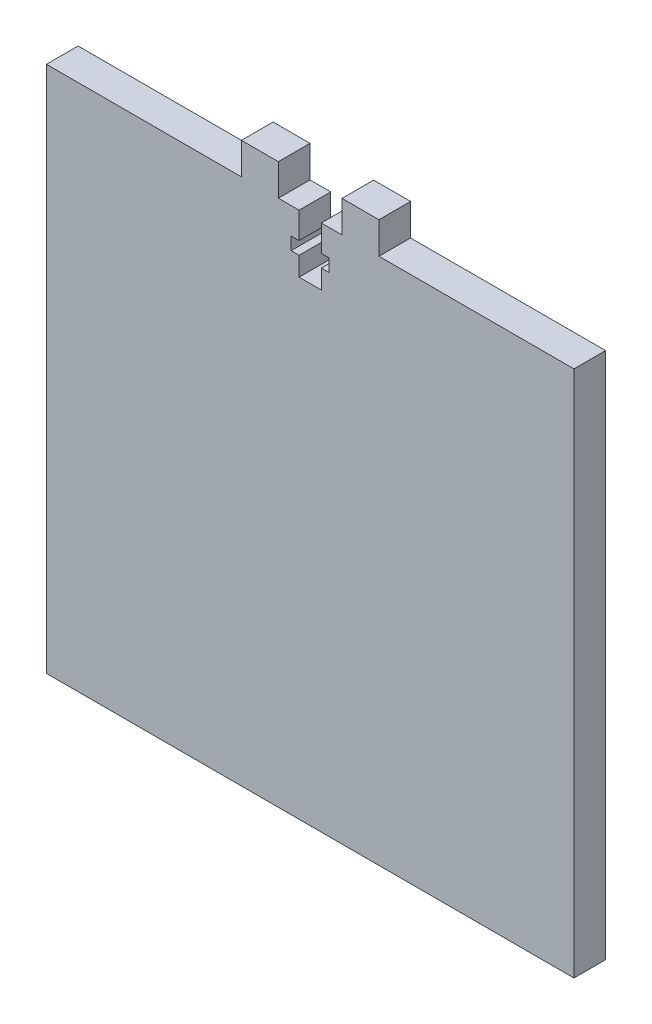
ISO-10303-21;
HEADER;
FILE_DESCRIPTION(('STEP AP214'),'2;1');
FILE_NAME('part.step','',(''),(''),'','','');
FILE_SCHEMA(('AUTOMOTIVE_DESIGN { 1 0 10303 214 1 1 1 1 }'));
ENDSEC;
DATA;
#1=APPLICATION_CONTEXT('core data for automotive mechanical design processes');
#2=APPLICATION_PROTOCOL_DEFINITION('international standard','automotive_design',2000,#1);
#3=PRODUCT_CONTEXT('',#1,'mechanical');
#4=PRODUCT('Part','Part','',(#3));
#5=PRODUCT_RELATED_PRODUCT_CATEGORY('part','',(#4));
#6=PRODUCT_DEFINITION_FORMATION('','',#4);
#7=PRODUCT_DEFINITION_CONTEXT('part definition',#1,'design');
#8=PRODUCT_DEFINITION('design','',#6,#7);
#9=PRODUCT_DEFINITION_SHAPE('','',#8);
#10=(LENGTH_UNIT() NAMED_UNIT(*) SI_UNIT(.MILLI.,.METRE.));
#11=(NAMED_UNIT(*) PLANE_ANGLE_UNIT() SI_UNIT($,.RADIAN.));
#12=(NAMED_UNIT(*) SI_UNIT($,.STERADIAN.) SOLID_ANGLE_UNIT());
#13=UNCERTAINTY_MEASURE_WITH_UNIT(LENGTH_MEASURE(1.E-05),#10,'distance_accuracy_value','');
#14=(GEOMETRIC_REPRESENTATION_CONTEXT(3) GLOBAL_UNCERTAINTY_ASSIGNED_CONTEXT((#13)) GLOBAL_UNIT_ASSIGNED_CONTEXT((#10,
#11,#12)) REPRESENTATION_CONTEXT('',''));
#15=CARTESIAN_POINT('',(0.,0.,0.));
#16=DIRECTION('',(0.,0.,1.));
#17=DIRECTION('',(1.,0.,0.));
#18=AXIS2_PLACEMENT_3D('',#15,#16,#17);
#19=CARTESIAN_POINT('',(-50.,50.,6.));
#20=DIRECTION('',(0.,-1.,0.));
#21=DIRECTION('',(0.,0.,-1.));
#22=AXIS2_PLACEMENT_3D('',#19,#20,#21);
#23=PLANE('',#22);
#24=DIRECTION('',(-1.,0.,0.));
#25=VECTOR('',#24,1.);
#26=CARTESIAN_POINT('',(-50.,50.,6.));
#27=LINE('',#26,#25);
#28=CARTESIAN_POINT('',(-2.10000000000001,50.,6.));
#29=VERTEX_POINT('',#28);
#30=CARTESIAN_POINT('',(-6.03184990821574,50.,6.));
#31=VERTEX_POINT('',#30);
#32=EDGE_CURVE('E358',#29,#31,#27,.T.);
#33=ORIENTED_EDGE('',*,*,#32,.F.);
#34=DIRECTION('',(0.,0.,1.));
#35=VECTOR('',#34,1.);
#36=CARTESIAN_POINT('',(-2.10000000000001,50.,0.));
#37=LINE('',#36,#35);
#38=CARTESIAN_POINT('',(-2.10000000000001,50.,0.));
#39=VERTEX_POINT('',#38);
#40=EDGE_CURVE('E275',#39,#29,#37,.T.);
#41=ORIENTED_EDGE('',*,*,#40,.F.);
#42=DIRECTION('',(-1.,0.,0.));
#43=VECTOR('',#42,1.);
#44=CARTESIAN_POINT('',(-50.,50.,0.));
#45=LINE('',#44,#43);
#46=CARTESIAN_POINT('',(-6.03184990821574,50.,0.));
#47=VERTEX_POINT('',#46);
#48=EDGE_CURVE('E219',#39,#47,#45,.T.);
#49=ORIENTED_EDGE('',*,*,#48,.T.);
#50=DIRECTION('',(0.,0.,1.));
#51=VECTOR('',#50,1.);
#52=CARTESIAN_POINT('',(-6.03184990821574,50.,0.));
#53=LINE('',#52,#51);
#54=EDGE_CURVE('E345',#47,#31,#53,.T.);
#55=ORIENTED_EDGE('',*,*,#54,.T.);
#56=EDGE_LOOP('',(#33,#41,#49,#55));
#57=FACE_BOUND('',#56,.T.);
#58=ADVANCED_FACE('F35',(#57),#23,.F.);
#59=CARTESIAN_POINT('',(50.,50.,0.));
#60=VERTEX_POINT('',#59);
#61=CARTESIAN_POINT('',(13.0318499082157,50.,0.));
#62=VERTEX_POINT('',#61);
#63=EDGE_CURVE('E366',#60,#62,#45,.T.);
#64=ORIENTED_EDGE('',*,*,#63,.T.);
#65=DIRECTION('',(0.,0.,1.));
#66=VECTOR('',#65,1.);
#67=CARTESIAN_POINT('',(13.0318499082157,50.,0.));
#68=LINE('',#67,#66);
#69=CARTESIAN_POINT('',(13.0318499082157,50.,6.));
#70=VERTEX_POINT('',#69);
#71=EDGE_CURVE('E315',#62,#70,#68,.T.);
#72=ORIENTED_EDGE('',*,*,#71,.T.);
#73=CARTESIAN_POINT('',(50.,50.,6.));
#74=VERTEX_POINT('',#73);
#75=EDGE_CURVE('E354',#74,#70,#27,.T.);
#76=ORIENTED_EDGE('',*,*,#75,.F.);
#77=DIRECTION('',(0.,0.,-1.));
#78=VECTOR('',#77,1.);
#79=CARTESIAN_POINT('',(50.,50.,6.));
#80=LINE('',#79,#78);
#81=EDGE_CURVE('E11',#74,#60,#80,.T.);
#82=ORIENTED_EDGE('',*,*,#81,.T.);
#83=EDGE_LOOP('',(#64,#72,#76,#82));
#84=FACE_BOUND('',#83,.T.);
#85=ADVANCED_FACE('F465',(#84),#23,.F.);
#86=DIRECTION('',(0.,0.,1.));
#87=VECTOR('',#86,1.);
#88=CARTESIAN_POINT('',(-13.0318499082157,50.,0.));
#89=LINE('',#88,#87);
#90=CARTESIAN_POINT('',(-13.0318499082157,50.,0.));
#91=VERTEX_POINT('',#90);
#92=CARTESIAN_POINT('',(-13.0318499082157,50.,6.));
#93=VERTEX_POINT('',#92);
#94=EDGE_CURVE('E332',#91,#93,#89,.T.);
#95=ORIENTED_EDGE('',*,*,#94,.F.);
#96=CARTESIAN_POINT('',(-50.,50.,0.));
#97=VERTEX_POINT('',#96);
#98=EDGE_CURVE('E365',#91,#97,#45,.T.);
#99=ORIENTED_EDGE('',*,*,#98,.T.);
#100=DIRECTION('',(0.,0.,-1.));
#101=VECTOR('',#100,1.);
#102=CARTESIAN_POINT('',(-50.,50.,6.));
#103=LINE('',#102,#101);
#104=CARTESIAN_POINT('',(-50.,50.,6.));
#105=VERTEX_POINT('',#104);
#106=EDGE_CURVE('E43',#105,#97,#103,.T.);
#107=ORIENTED_EDGE('',*,*,#106,.F.);
#108=EDGE_CURVE('E352',#93,#105,#27,.T.);
#109=ORIENTED_EDGE('',*,*,#108,.F.);
#110=EDGE_LOOP('',(#95,#99,#107,#109));
#111=FACE_BOUND('',#110,.T.);
#112=ADVANCED_FACE('F410',(#111),#23,.F.);
#113=CARTESIAN_POINT('',(50.,-50.,6.));
#114=DIRECTION('',(-1.,0.,0.));
#115=DIRECTION('',(0.,0.,1.));
#116=AXIS2_PLACEMENT_3D('',#113,#114,#115);
#117=PLANE('',#116);
#118=DIRECTION('',(0.,1.,0.));
#119=VECTOR('',#118,1.);
#120=CARTESIAN_POINT('',(50.,-50.,0.));
#121=LINE('',#120,#119);
#122=CARTESIAN_POINT('',(50.,-50.,0.));
#123=VERTEX_POINT('',#122);
#124=EDGE_CURVE('E342',#123,#60,#121,.T.);
#125=ORIENTED_EDGE('',*,*,#124,.T.);
#126=ORIENTED_EDGE('',*,*,#81,.F.);
#127=DIRECTION('',(0.,1.,0.));
#128=VECTOR('',#127,1.);
#129=CARTESIAN_POINT('',(50.,-50.,6.));
#130=LINE('',#129,#128);
#131=CARTESIAN_POINT('',(50.,-50.,6.));
#132=VERTEX_POINT('',#131);
#133=EDGE_CURVE('E349',#132,#74,#130,.T.);
#134=ORIENTED_EDGE('',*,*,#133,.F.);
#135=DIRECTION('',(0.,0.,-1.));
#136=VECTOR('',#135,1.);
#137=CARTESIAN_POINT('',(50.,-50.,6.));
#138=LINE('',#137,#136);
#139=EDGE_CURVE('E362',#132,#123,#138,.T.);
#140=ORIENTED_EDGE('',*,*,#139,.T.);
#141=EDGE_LOOP('',(#125,#126,#134,#140));
#142=FACE_BOUND('',#141,.T.);
#143=ADVANCED_FACE('F37',(#142),#117,.F.);
#144=CARTESIAN_POINT('',(6.03184990821572,50.,0.));
#145=VERTEX_POINT('',#144);
#146=CARTESIAN_POINT('',(2.09999999999999,50.,0.));
#147=VERTEX_POINT('',#146);
#148=EDGE_CURVE('E369',#145,#147,#45,.T.);
#149=ORIENTED_EDGE('',*,*,#148,.T.);
#150=DIRECTION('',(0.,0.,1.));
#151=VECTOR('',#150,1.);
#152=CARTESIAN_POINT('',(2.09999999999999,50.,0.));
#153=LINE('',#152,#151);
#154=CARTESIAN_POINT('',(2.09999999999999,50.,6.));
#155=VERTEX_POINT('',#154);
#156=EDGE_CURVE('E278',#147,#155,#153,.T.);
#157=ORIENTED_EDGE('',*,*,#156,.T.);
#158=CARTESIAN_POINT('',(6.03184990821572,50.,6.));
#159=VERTEX_POINT('',#158);
#160=EDGE_CURVE('E58',#159,#155,#27,.T.);
#161=ORIENTED_EDGE('',*,*,#160,.F.);
#162=DIRECTION('',(0.,0.,1.));
#163=VECTOR('',#162,1.);
#164=CARTESIAN_POINT('',(6.03184990821572,50.,0.));
#165=LINE('',#164,#163);
#166=EDGE_CURVE('E318',#145,#159,#165,.T.);
#167=ORIENTED_EDGE('',*,*,#166,.F.);
#168=EDGE_LOOP('',(#149,#157,#161,#167));
#169=FACE_BOUND('',#168,.T.);
#170=ADVANCED_FACE('F409',(#169),#23,.F.);
#171=CARTESIAN_POINT('',(-50.,-50.,6.));
#172=DIRECTION('',(1.,0.,0.));
#173=DIRECTION('',(0.,0.,-1.));
#174=AXIS2_PLACEMENT_3D('',#171,#172,#173);
#175=PLANE('',#174);
#176=DIRECTION('',(0.,-1.,0.));
#177=VECTOR('',#176,1.);
#178=CARTESIAN_POINT('',(-50.,-50.,0.));
#179=LINE('',#178,#177);
#180=CARTESIAN_POINT('',(-50.,-50.,0.));
#181=VERTEX_POINT('',#180);
#182=EDGE_CURVE('E368',#97,#181,#179,.T.);
#183=ORIENTED_EDGE('',*,*,#182,.T.);
#184=DIRECTION('',(0.,0.,-1.));
#185=VECTOR('',#184,1.);
#186=CARTESIAN_POINT('',(-50.,-50.,6.));
#187=LINE('',#186,#185);
#188=CARTESIAN_POINT('',(-50.,-50.,6.));
#189=VERTEX_POINT('',#188);
#190=EDGE_CURVE('E374',#189,#181,#187,.T.);
#191=ORIENTED_EDGE('',*,*,#190,.F.);
#192=DIRECTION('',(0.,-1.,0.));
#193=VECTOR('',#192,1.);
#194=CARTESIAN_POINT('',(-50.,-50.,6.));
#195=LINE('',#194,#193);
#196=EDGE_CURVE('E357',#105,#189,#195,.T.);
#197=ORIENTED_EDGE('',*,*,#196,.F.);
#198=ORIENTED_EDGE('',*,*,#106,.T.);
#199=EDGE_LOOP('',(#183,#191,#197,#198));
#200=FACE_BOUND('',#199,.T.);
#201=ADVANCED_FACE('F381',(#200),#175,.F.);
#202=CARTESIAN_POINT('',(-50.,-50.,6.));
#203=DIRECTION('',(0.,1.,0.));
#204=DIRECTION('',(0.,0.,1.));
#205=AXIS2_PLACEMENT_3D('',#202,#203,#204);
#206=PLANE('',#205);
#207=DIRECTION('',(1.,0.,0.));
#208=VECTOR('',#207,1.);
#209=CARTESIAN_POINT('',(-50.,-50.,0.));
#210=LINE('',#209,#208);
#211=EDGE_CURVE('E353',#181,#123,#210,.T.);
#212=ORIENTED_EDGE('',*,*,#211,.T.);
#213=ORIENTED_EDGE('',*,*,#139,.F.);
#214=DIRECTION('',(1.,0.,0.));
#215=VECTOR('',#214,1.);
#216=CARTESIAN_POINT('',(-50.,-50.,6.));
#217=LINE('',#216,#215);
#218=EDGE_CURVE('E360',#189,#132,#217,.T.);
#219=ORIENTED_EDGE('',*,*,#218,.F.);
#220=ORIENTED_EDGE('',*,*,#190,.T.);
#221=EDGE_LOOP('',(#212,#213,#219,#220));
#222=FACE_BOUND('',#221,.T.);
#223=ADVANCED_FACE('F391',(#222),#206,.F.);
#224=CARTESIAN_POINT('',(0.,0.,6.));
#225=DIRECTION('',(0.,0.,-1.));
#226=DIRECTION('',(-1.,0.,0.));
#227=AXIS2_PLACEMENT_3D('',#224,#225,#226);
#228=PLANE('',#227);
#229=DIRECTION('',(-1.,0.,0.));
#230=VECTOR('',#229,1.);
#231=CARTESIAN_POINT('',(-2.10000000000001,45.,6.));
#232=LINE('',#231,#230);
#233=CARTESIAN_POINT('',(-2.10000000000001,45.,6.));
#234=VERTEX_POINT('',#233);
#235=CARTESIAN_POINT('',(-3.60000000000001,45.,6.));
#236=VERTEX_POINT('',#235);
#237=EDGE_CURVE('E250',#234,#236,#232,.T.);
#238=ORIENTED_EDGE('',*,*,#237,.F.);
#239=DIRECTION('',(0.,-1.,0.));
#240=VECTOR('',#239,1.);
#241=CARTESIAN_POINT('',(-2.10000000000001,45.,6.));
#242=LINE('',#241,#240);
#243=EDGE_CURVE('E204',#29,#234,#242,.T.);
#244=ORIENTED_EDGE('',*,*,#243,.F.);
#245=ORIENTED_EDGE('',*,*,#32,.T.);
#246=DIRECTION('',(0.,1.,0.));
#247=VECTOR('',#246,1.);
#248=CARTESIAN_POINT('',(-6.03184990821574,50.,6.));
#249=LINE('',#248,#247);
#250=CARTESIAN_POINT('',(-6.03184990821574,56.,6.));
#251=VERTEX_POINT('',#250);
#252=EDGE_CURVE('E335',#31,#251,#249,.T.);
#253=ORIENTED_EDGE('',*,*,#252,.T.);
#254=DIRECTION('',(-1.,0.,0.));
#255=VECTOR('',#254,1.);
#256=CARTESIAN_POINT('',(-13.0318499082157,56.,6.));
#257=LINE('',#256,#255);
#258=CARTESIAN_POINT('',(-13.0318499082157,56.,6.));
#259=VERTEX_POINT('',#258);
#260=EDGE_CURVE('E326',#251,#259,#257,.T.);
#261=ORIENTED_EDGE('',*,*,#260,.T.);
#262=DIRECTION('',(0.,-1.,0.));
#263=VECTOR('',#262,1.);
#264=CARTESIAN_POINT('',(-13.0318499082157,50.,6.));
#265=LINE('',#264,#263);
#266=EDGE_CURVE('E317',#259,#93,#265,.T.);
#267=ORIENTED_EDGE('',*,*,#266,.T.);
#268=ORIENTED_EDGE('',*,*,#108,.T.);
#269=ORIENTED_EDGE('',*,*,#196,.T.);
#270=ORIENTED_EDGE('',*,*,#218,.T.);
#271=ORIENTED_EDGE('',*,*,#133,.T.);
#272=ORIENTED_EDGE('',*,*,#75,.T.);
#273=DIRECTION('',(0.,1.,0.));
#274=VECTOR('',#273,1.);
#275=CARTESIAN_POINT('',(13.0318499082157,50.,6.));
#276=LINE('',#275,#274);
#277=CARTESIAN_POINT('',(13.0318499082157,56.,6.));
#278=VERTEX_POINT('',#277);
#279=EDGE_CURVE('E277',#70,#278,#276,.T.);
#280=ORIENTED_EDGE('',*,*,#279,.T.);
#281=DIRECTION('',(-1.,0.,0.));
#282=VECTOR('',#281,1.);
#283=CARTESIAN_POINT('',(13.0318499082157,56.,6.));
#284=LINE('',#283,#282);
#285=CARTESIAN_POINT('',(6.03184990821572,56.,6.));
#286=VERTEX_POINT('',#285);
#287=EDGE_CURVE('E310',#278,#286,#284,.T.);
#288=ORIENTED_EDGE('',*,*,#287,.T.);
#289=DIRECTION('',(0.,-1.,0.));
#290=VECTOR('',#289,1.);
#291=CARTESIAN_POINT('',(6.03184990821572,50.,6.));
#292=LINE('',#291,#290);
#293=EDGE_CURVE('E301',#286,#159,#292,.T.);
#294=ORIENTED_EDGE('',*,*,#293,.T.);
#295=ORIENTED_EDGE('',*,*,#160,.T.);
#296=DIRECTION('',(0.,1.,0.));
#297=VECTOR('',#296,1.);
#298=CARTESIAN_POINT('',(2.09999999999999,50.,6.));
#299=LINE('',#298,#297);
#300=CARTESIAN_POINT('',(2.09999999999999,45.,6.));
#301=VERTEX_POINT('',#300);
#302=EDGE_CURVE('E220',#301,#155,#299,.T.);
#303=ORIENTED_EDGE('',*,*,#302,.F.);
#304=DIRECTION('',(-1.,0.,0.));
#305=VECTOR('',#304,1.);
#306=CARTESIAN_POINT('',(2.09999999999999,45.,6.));
#307=LINE('',#306,#305);
#308=CARTESIAN_POINT('',(3.59999999999999,45.,6.));
#309=VERTEX_POINT('',#308);
#310=EDGE_CURVE('E222',#309,#301,#307,.T.);
#311=ORIENTED_EDGE('',*,*,#310,.F.);
#312=DIRECTION('',(0.,1.,0.));
#313=VECTOR('',#312,1.);
#314=CARTESIAN_POINT('',(3.59999999999999,45.,6.));
#315=LINE('',#314,#313);
#316=CARTESIAN_POINT('',(3.59999999999999,42.6,6.));
#317=VERTEX_POINT('',#316);
#318=EDGE_CURVE('E270',#317,#309,#315,.T.);
#319=ORIENTED_EDGE('',*,*,#318,.F.);
#320=DIRECTION('',(1.,0.,0.));
#321=VECTOR('',#320,1.);
#322=CARTESIAN_POINT('',(3.59999999999999,42.6,6.));
#323=LINE('',#322,#321);
#324=CARTESIAN_POINT('',(2.09999999999999,42.6,6.));
#325=VERTEX_POINT('',#324);
#326=EDGE_CURVE('E267',#325,#317,#323,.T.);
#327=ORIENTED_EDGE('',*,*,#326,.F.);
#328=DIRECTION('',(0.,1.,0.));
#329=VECTOR('',#328,1.);
#330=CARTESIAN_POINT('',(2.09999999999999,42.6,6.));
#331=LINE('',#330,#329);
#332=CARTESIAN_POINT('',(2.09999999999999,39.,6.));
#333=VERTEX_POINT('',#332);
#334=EDGE_CURVE('E264',#333,#325,#331,.T.);
#335=ORIENTED_EDGE('',*,*,#334,.F.);
#336=DIRECTION('',(1.,0.,0.));
#337=VECTOR('',#336,1.);
#338=CARTESIAN_POINT('',(2.09999999999999,39.,6.));
#339=LINE('',#338,#337);
#340=CARTESIAN_POINT('',(-2.10000000000001,39.,6.));
#341=VERTEX_POINT('',#340);
#342=EDGE_CURVE('E261',#341,#333,#339,.T.);
#343=ORIENTED_EDGE('',*,*,#342,.F.);
#344=DIRECTION('',(0.,-1.,0.));
#345=VECTOR('',#344,1.);
#346=CARTESIAN_POINT('',(-2.10000000000001,39.,6.));
#347=LINE('',#346,#345);
#348=CARTESIAN_POINT('',(-2.10000000000001,42.6,6.));
#349=VERTEX_POINT('',#348);
#350=EDGE_CURVE('E258',#349,#341,#347,.T.);
#351=ORIENTED_EDGE('',*,*,#350,.F.);
#352=DIRECTION('',(1.,0.,0.));
#353=VECTOR('',#352,1.);
#354=CARTESIAN_POINT('',(-3.60000000000001,42.6,6.));
#355=LINE('',#354,#353);
#356=CARTESIAN_POINT('',(-3.60000000000001,42.6,6.));
#357=VERTEX_POINT('',#356);
#358=EDGE_CURVE('E255',#357,#349,#355,.T.);
#359=ORIENTED_EDGE('',*,*,#358,.F.);
#360=DIRECTION('',(0.,-1.,0.));
#361=VECTOR('',#360,1.);
#362=CARTESIAN_POINT('',(-3.60000000000001,45.,6.));
#363=LINE('',#362,#361);
#364=EDGE_CURVE('E252',#236,#357,#363,.T.);
#365=ORIENTED_EDGE('',*,*,#364,.F.);
#366=EDGE_LOOP('',(#238,#244,#245,#253,#261,#267,#268,#269,#270,#271,#272,#280,#288,#294,#295,
#303,#311,#319,#327,#335,#343,#351,#359,#365));
#367=FACE_BOUND('',#366,.T.);
#368=ADVANCED_FACE('F397',(#367),#228,.F.);
#369=CARTESIAN_POINT('',(0.,0.,0.));
#370=DIRECTION('',(0.,0.,-1.));
#371=DIRECTION('',(-1.,0.,0.));
#372=AXIS2_PLACEMENT_3D('',#369,#370,#371);
#373=PLANE('',#372);
#374=DIRECTION('',(0.,-1.,0.));
#375=VECTOR('',#374,1.);
#376=CARTESIAN_POINT('',(-2.10000000000001,45.,0.));
#377=LINE('',#376,#375);
#378=CARTESIAN_POINT('',(-2.10000000000001,45.,0.));
#379=VERTEX_POINT('',#378);
#380=EDGE_CURVE('E201',#39,#379,#377,.T.);
#381=ORIENTED_EDGE('',*,*,#380,.T.);
#382=DIRECTION('',(-1.,0.,0.));
#383=VECTOR('',#382,1.);
#384=CARTESIAN_POINT('',(-2.10000000000001,45.,0.));
#385=LINE('',#384,#383);
#386=CARTESIAN_POINT('',(-3.60000000000001,45.,0.));
#387=VERTEX_POINT('',#386);
#388=EDGE_CURVE('E212',#379,#387,#385,.T.);
#389=ORIENTED_EDGE('',*,*,#388,.T.);
#390=DIRECTION('',(0.,-1.,0.));
#391=VECTOR('',#390,1.);
#392=CARTESIAN_POINT('',(-3.60000000000001,45.,0.));
#393=LINE('',#392,#391);
#394=CARTESIAN_POINT('',(-3.60000000000001,42.6,0.));
#395=VERTEX_POINT('',#394);
#396=EDGE_CURVE('E50',#387,#395,#393,.T.);
#397=ORIENTED_EDGE('',*,*,#396,.T.);
#398=DIRECTION('',(1.,0.,0.));
#399=VECTOR('',#398,1.);
#400=CARTESIAN_POINT('',(-3.60000000000001,42.6,0.));
#401=LINE('',#400,#399);
#402=CARTESIAN_POINT('',(-2.10000000000001,42.6,0.));
#403=VERTEX_POINT('',#402);
#404=EDGE_CURVE('E226',#395,#403,#401,.T.);
#405=ORIENTED_EDGE('',*,*,#404,.T.);
#406=DIRECTION('',(0.,-1.,0.));
#407=VECTOR('',#406,1.);
#408=CARTESIAN_POINT('',(-2.10000000000001,39.,0.));
#409=LINE('',#408,#407);
#410=CARTESIAN_POINT('',(-2.10000000000001,39.,0.));
#411=VERTEX_POINT('',#410);
#412=EDGE_CURVE('E229',#403,#411,#409,.T.);
#413=ORIENTED_EDGE('',*,*,#412,.T.);
#414=DIRECTION('',(1.,0.,0.));
#415=VECTOR('',#414,1.);
#416=CARTESIAN_POINT('',(2.09999999999999,39.,0.));
#417=LINE('',#416,#415);
#418=CARTESIAN_POINT('',(2.09999999999999,39.,0.));
#419=VERTEX_POINT('',#418);
#420=EDGE_CURVE('E232',#411,#419,#417,.T.);
#421=ORIENTED_EDGE('',*,*,#420,.T.);
#422=DIRECTION('',(0.,1.,0.));
#423=VECTOR('',#422,1.);
#424=CARTESIAN_POINT('',(2.09999999999999,42.6,0.));
#425=LINE('',#424,#423);
#426=CARTESIAN_POINT('',(2.09999999999999,42.6,0.));
#427=VERTEX_POINT('',#426);
#428=EDGE_CURVE('E235',#419,#427,#425,.T.);
#429=ORIENTED_EDGE('',*,*,#428,.T.);
#430=DIRECTION('',(1.,0.,0.));
#431=VECTOR('',#430,1.);
#432=CARTESIAN_POINT('',(3.59999999999999,42.6,0.));
#433=LINE('',#432,#431);
#434=CARTESIAN_POINT('',(3.59999999999999,42.6,0.));
#435=VERTEX_POINT('',#434);
#436=EDGE_CURVE('E238',#427,#435,#433,.T.);
#437=ORIENTED_EDGE('',*,*,#436,.T.);
#438=DIRECTION('',(0.,1.,0.));
#439=VECTOR('',#438,1.);
#440=CARTESIAN_POINT('',(3.59999999999999,45.,0.));
#441=LINE('',#440,#439);
#442=CARTESIAN_POINT('',(3.59999999999999,45.,0.));
#443=VERTEX_POINT('',#442);
#444=EDGE_CURVE('E241',#435,#443,#441,.T.);
#445=ORIENTED_EDGE('',*,*,#444,.T.);
#446=DIRECTION('',(-1.,0.,0.));
#447=VECTOR('',#446,1.);
#448=CARTESIAN_POINT('',(2.09999999999999,45.,0.));
#449=LINE('',#448,#447);
#450=CARTESIAN_POINT('',(2.09999999999999,45.,0.));
#451=VERTEX_POINT('',#450);
#452=EDGE_CURVE('E244',#443,#451,#449,.T.);
#453=ORIENTED_EDGE('',*,*,#452,.T.);
#454=DIRECTION('',(0.,1.,0.));
#455=VECTOR('',#454,1.);
#456=CARTESIAN_POINT('',(2.09999999999999,50.,0.));
#457=LINE('',#456,#455);
#458=EDGE_CURVE('E209',#451,#147,#457,.T.);
#459=ORIENTED_EDGE('',*,*,#458,.T.);
#460=ORIENTED_EDGE('',*,*,#148,.F.);
#461=DIRECTION('',(0.,-1.,0.));
#462=VECTOR('',#461,1.);
#463=CARTESIAN_POINT('',(6.03184990821572,50.,0.));
#464=LINE('',#463,#462);
#465=CARTESIAN_POINT('',(6.03184990821572,56.,0.));
#466=VERTEX_POINT('',#465);
#467=EDGE_CURVE('E304',#466,#145,#464,.T.);
#468=ORIENTED_EDGE('',*,*,#467,.F.);
#469=DIRECTION('',(-1.,0.,0.));
#470=VECTOR('',#469,1.);
#471=CARTESIAN_POINT('',(13.0318499082157,56.,0.));
#472=LINE('',#471,#470);
#473=CARTESIAN_POINT('',(13.0318499082157,56.,0.));
#474=VERTEX_POINT('',#473);
#475=EDGE_CURVE('E300',#474,#466,#472,.T.);
#476=ORIENTED_EDGE('',*,*,#475,.F.);
#477=DIRECTION('',(0.,1.,0.));
#478=VECTOR('',#477,1.);
#479=CARTESIAN_POINT('',(13.0318499082157,50.,0.));
#480=LINE('',#479,#478);
#481=EDGE_CURVE('E297',#62,#474,#480,.T.);
#482=ORIENTED_EDGE('',*,*,#481,.F.);
#483=ORIENTED_EDGE('',*,*,#63,.F.);
#484=ORIENTED_EDGE('',*,*,#124,.F.);
#485=ORIENTED_EDGE('',*,*,#211,.F.);
#486=ORIENTED_EDGE('',*,*,#182,.F.);
#487=ORIENTED_EDGE('',*,*,#98,.F.);
#488=DIRECTION('',(0.,-1.,0.));
#489=VECTOR('',#488,1.);
#490=CARTESIAN_POINT('',(-13.0318499082157,50.,0.));
#491=LINE('',#490,#489);
#492=CARTESIAN_POINT('',(-13.0318499082157,56.,0.));
#493=VERTEX_POINT('',#492);
#494=EDGE_CURVE('E323',#493,#91,#491,.T.);
#495=ORIENTED_EDGE('',*,*,#494,.F.);
#496=DIRECTION('',(-1.,0.,0.));
#497=VECTOR('',#496,1.);
#498=CARTESIAN_POINT('',(-13.0318499082157,56.,0.));
#499=LINE('',#498,#497);
#500=CARTESIAN_POINT('',(-6.03184990821574,56.,0.));
#501=VERTEX_POINT('',#500);
#502=EDGE_CURVE('E329',#501,#493,#499,.T.);
#503=ORIENTED_EDGE('',*,*,#502,.F.);
#504=DIRECTION('',(0.,1.,0.));
#505=VECTOR('',#504,1.);
#506=CARTESIAN_POINT('',(-6.03184990821574,50.,0.));
#507=LINE('',#506,#505);
#508=EDGE_CURVE('E325',#47,#501,#507,.T.);
#509=ORIENTED_EDGE('',*,*,#508,.F.);
#510=ORIENTED_EDGE('',*,*,#48,.F.);
#511=EDGE_LOOP('',(#381,#389,#397,#405,#413,#421,#429,#437,#445,#453,#459,#460,#468,#476,#482,
#483,#484,#485,#486,#487,#495,#503,#509,#510));
#512=FACE_BOUND('',#511,.T.);
#513=ADVANCED_FACE('F217',(#512),#373,.T.);
#514=CARTESIAN_POINT('',(-13.0318499082157,50.,0.));
#515=DIRECTION('',(-1.,0.,0.));
#516=DIRECTION('',(0.,0.,1.));
#517=AXIS2_PLACEMENT_3D('',#514,#515,#516);
#518=PLANE('',#517);
#519=ORIENTED_EDGE('',*,*,#266,.F.);
#520=DIRECTION('',(0.,0.,1.));
#521=VECTOR('',#520,1.);
#522=CARTESIAN_POINT('',(-13.0318499082157,56.,0.));
#523=LINE('',#522,#521);
#524=EDGE_CURVE('E340',#493,#259,#523,.T.);
#525=ORIENTED_EDGE('',*,*,#524,.F.);
#526=ORIENTED_EDGE('',*,*,#494,.T.);
#527=ORIENTED_EDGE('',*,*,#94,.T.);
#528=EDGE_LOOP('',(#519,#525,#526,#527));
#529=FACE_BOUND('',#528,.T.);
#530=ADVANCED_FACE('F412',(#529),#518,.T.);
#531=CARTESIAN_POINT('',(-13.0318499082157,56.,0.));
#532=DIRECTION('',(0.,1.,0.));
#533=DIRECTION('',(0.,0.,1.));
#534=AXIS2_PLACEMENT_3D('',#531,#532,#533);
#535=PLANE('',#534);
#536=ORIENTED_EDGE('',*,*,#260,.F.);
#537=DIRECTION('',(0.,0.,1.));
#538=VECTOR('',#537,1.);
#539=CARTESIAN_POINT('',(-6.03184990821574,56.,0.));
#540=LINE('',#539,#538);
#541=EDGE_CURVE('E343',#501,#251,#540,.T.);
#542=ORIENTED_EDGE('',*,*,#541,.F.);
#543=ORIENTED_EDGE('',*,*,#502,.T.);
#544=ORIENTED_EDGE('',*,*,#524,.T.);
#545=EDGE_LOOP('',(#536,#542,#543,#544));
#546=FACE_BOUND('',#545,.T.);
#547=ADVANCED_FACE('F416',(#546),#535,.T.);
#548=CARTESIAN_POINT('',(-6.03184990821574,50.,0.));
#549=DIRECTION('',(1.,0.,0.));
#550=DIRECTION('',(0.,1.,0.));
#551=AXIS2_PLACEMENT_3D('',#548,#549,#550);
#552=PLANE('',#551);
#553=ORIENTED_EDGE('',*,*,#252,.F.);
#554=ORIENTED_EDGE('',*,*,#54,.F.);
#555=ORIENTED_EDGE('',*,*,#508,.T.);
#556=ORIENTED_EDGE('',*,*,#541,.T.);
#557=EDGE_LOOP('',(#553,#554,#555,#556));
#558=FACE_BOUND('',#557,.T.);
#559=ADVANCED_FACE('F420',(#558),#552,.T.);
#560=CARTESIAN_POINT('',(13.0318499082157,50.,0.));
#561=DIRECTION('',(1.,0.,0.));
#562=DIRECTION('',(0.,0.,-1.));
#563=AXIS2_PLACEMENT_3D('',#560,#561,#562);
#564=PLANE('',#563);
#565=ORIENTED_EDGE('',*,*,#279,.F.);
#566=ORIENTED_EDGE('',*,*,#71,.F.);
#567=ORIENTED_EDGE('',*,*,#481,.T.);
#568=DIRECTION('',(0.,0.,1.));
#569=VECTOR('',#568,1.);
#570=CARTESIAN_POINT('',(13.0318499082157,56.,0.));
#571=LINE('',#570,#569);
#572=EDGE_CURVE('E307',#474,#278,#571,.T.);
#573=ORIENTED_EDGE('',*,*,#572,.T.);
#574=EDGE_LOOP('',(#565,#566,#567,#573));
#575=FACE_BOUND('',#574,.T.);
#576=ADVANCED_FACE('F557',(#575),#564,.T.);
#577=CARTESIAN_POINT('',(6.03184990821572,50.,0.));
#578=DIRECTION('',(-1.,0.,0.));
#579=DIRECTION('',(0.,0.,1.));
#580=AXIS2_PLACEMENT_3D('',#577,#578,#579);
#581=PLANE('',#580);
#582=ORIENTED_EDGE('',*,*,#293,.F.);
#583=DIRECTION('',(0.,0.,1.));
#584=VECTOR('',#583,1.);
#585=CARTESIAN_POINT('',(6.03184990821572,56.,0.));
#586=LINE('',#585,#584);
#587=EDGE_CURVE('E320',#466,#286,#586,.T.);
#588=ORIENTED_EDGE('',*,*,#587,.F.);
#589=ORIENTED_EDGE('',*,*,#467,.T.);
#590=ORIENTED_EDGE('',*,*,#166,.T.);
#591=EDGE_LOOP('',(#582,#588,#589,#590));
#592=FACE_BOUND('',#591,.T.);
#593=ADVANCED_FACE('F406',(#592),#581,.T.);
#594=CARTESIAN_POINT('',(13.0318499082157,56.,0.));
#595=DIRECTION('',(0.,1.,0.));
#596=DIRECTION('',(0.,0.,1.));
#597=AXIS2_PLACEMENT_3D('',#594,#595,#596);
#598=PLANE('',#597);
#599=ORIENTED_EDGE('',*,*,#287,.F.);
#600=ORIENTED_EDGE('',*,*,#572,.F.);
#601=ORIENTED_EDGE('',*,*,#475,.T.);
#602=ORIENTED_EDGE('',*,*,#587,.T.);
#603=EDGE_LOOP('',(#599,#600,#601,#602));
#604=FACE_BOUND('',#603,.T.);
#605=ADVANCED_FACE('F462',(#604),#598,.T.);
#606=CARTESIAN_POINT('',(-2.10000000000001,45.,0.));
#607=DIRECTION('',(-1.,0.,0.));
#608=DIRECTION('',(0.,-1.,0.));
#609=AXIS2_PLACEMENT_3D('',#606,#607,#608);
#610=PLANE('',#609);
#611=ORIENTED_EDGE('',*,*,#243,.T.);
#612=DIRECTION('',(0.,0.,1.));
#613=VECTOR('',#612,1.);
#614=CARTESIAN_POINT('',(-2.10000000000001,45.,0.));
#615=LINE('',#614,#613);
#616=EDGE_CURVE('E197',#379,#234,#615,.T.);
#617=ORIENTED_EDGE('',*,*,#616,.F.);
#618=ORIENTED_EDGE('',*,*,#380,.F.);
#619=ORIENTED_EDGE('',*,*,#40,.T.);
#620=EDGE_LOOP('',(#611,#617,#618,#619));
#621=FACE_BOUND('',#620,.T.);
#622=ADVANCED_FACE('F199',(#621),#610,.F.);
#623=CARTESIAN_POINT('',(2.09999999999999,50.,0.));
#624=DIRECTION('',(1.,0.,0.));
#625=DIRECTION('',(0.,1.,0.));
#626=AXIS2_PLACEMENT_3D('',#623,#624,#625);
#627=PLANE('',#626);
#628=ORIENTED_EDGE('',*,*,#302,.T.);
#629=ORIENTED_EDGE('',*,*,#156,.F.);
#630=ORIENTED_EDGE('',*,*,#458,.F.);
#631=DIRECTION('',(0.,0.,1.));
#632=VECTOR('',#631,1.);
#633=CARTESIAN_POINT('',(2.09999999999999,45.,0.));
#634=LINE('',#633,#632);
#635=EDGE_CURVE('E280',#451,#301,#634,.T.);
#636=ORIENTED_EDGE('',*,*,#635,.T.);
#637=EDGE_LOOP('',(#628,#629,#630,#636));
#638=FACE_BOUND('',#637,.T.);
#639=ADVANCED_FACE('F454',(#638),#627,.F.);
#640=CARTESIAN_POINT('',(2.09999999999999,45.,0.));
#641=DIRECTION('',(0.,1.,0.));
#642=DIRECTION('',(0.,0.,1.));
#643=AXIS2_PLACEMENT_3D('',#640,#641,#642);
#644=PLANE('',#643);
#645=ORIENTED_EDGE('',*,*,#310,.T.);
#646=ORIENTED_EDGE('',*,*,#635,.F.);
#647=ORIENTED_EDGE('',*,*,#452,.F.);
#648=DIRECTION('',(0.,0.,1.));
#649=VECTOR('',#648,1.);
#650=CARTESIAN_POINT('',(3.59999999999999,45.,0.));
#651=LINE('',#650,#649);
#652=EDGE_CURVE('E282',#443,#309,#651,.T.);
#653=ORIENTED_EDGE('',*,*,#652,.T.);
#654=EDGE_LOOP('',(#645,#646,#647,#653));
#655=FACE_BOUND('',#654,.T.);
#656=ADVANCED_FACE('F451',(#655),#644,.F.);
#657=CARTESIAN_POINT('',(3.59999999999999,45.,0.));
#658=DIRECTION('',(1.,0.,0.));
#659=DIRECTION('',(0.,1.,0.));
#660=AXIS2_PLACEMENT_3D('',#657,#658,#659);
#661=PLANE('',#660);
#662=ORIENTED_EDGE('',*,*,#318,.T.);
#663=ORIENTED_EDGE('',*,*,#652,.F.);
#664=ORIENTED_EDGE('',*,*,#444,.F.);
#665=DIRECTION('',(0.,0.,1.));
#666=VECTOR('',#665,1.);
#667=CARTESIAN_POINT('',(3.59999999999999,42.6,0.));
#668=LINE('',#667,#666);
#669=EDGE_CURVE('E284',#435,#317,#668,.T.);
#670=ORIENTED_EDGE('',*,*,#669,.T.);
#671=EDGE_LOOP('',(#662,#663,#664,#670));
#672=FACE_BOUND('',#671,.T.);
#673=ADVANCED_FACE('F448',(#672),#661,.F.);
#674=CARTESIAN_POINT('',(3.59999999999999,42.6,0.));
#675=DIRECTION('',(0.,-1.,0.));
#676=DIRECTION('',(0.,0.,-1.));
#677=AXIS2_PLACEMENT_3D('',#674,#675,#676);
#678=PLANE('',#677);
#679=ORIENTED_EDGE('',*,*,#326,.T.);
#680=ORIENTED_EDGE('',*,*,#669,.F.);
#681=ORIENTED_EDGE('',*,*,#436,.F.);
#682=DIRECTION('',(0.,0.,1.));
#683=VECTOR('',#682,1.);
#684=CARTESIAN_POINT('',(2.09999999999999,42.6,0.));
#685=LINE('',#684,#683);
#686=EDGE_CURVE('E286',#427,#325,#685,.T.);
#687=ORIENTED_EDGE('',*,*,#686,.T.);
#688=EDGE_LOOP('',(#679,#680,#681,#687));
#689=FACE_BOUND('',#688,.T.);
#690=ADVANCED_FACE('F444',(#689),#678,.F.);
#691=CARTESIAN_POINT('',(2.09999999999999,42.6,0.));
#692=DIRECTION('',(1.,0.,0.));
#693=DIRECTION('',(0.,1.,0.));
#694=AXIS2_PLACEMENT_3D('',#691,#692,#693);
#695=PLANE('',#694);
#696=ORIENTED_EDGE('',*,*,#334,.T.);
#697=ORIENTED_EDGE('',*,*,#686,.F.);
#698=ORIENTED_EDGE('',*,*,#428,.F.);
#699=DIRECTION('',(0.,0.,1.));
#700=VECTOR('',#699,1.);
#701=CARTESIAN_POINT('',(2.09999999999999,39.,0.));
#702=LINE('',#701,#700);
#703=EDGE_CURVE('E288',#419,#333,#702,.T.);
#704=ORIENTED_EDGE('',*,*,#703,.T.);
#705=EDGE_LOOP('',(#696,#697,#698,#704));
#706=FACE_BOUND('',#705,.T.);
#707=ADVANCED_FACE('F440',(#706),#695,.F.);
#708=CARTESIAN_POINT('',(2.09999999999999,39.,0.));
#709=DIRECTION('',(0.,-1.,0.));
#710=DIRECTION('',(0.,0.,-1.));
#711=AXIS2_PLACEMENT_3D('',#708,#709,#710);
#712=PLANE('',#711);
#713=ORIENTED_EDGE('',*,*,#342,.T.);
#714=ORIENTED_EDGE('',*,*,#703,.F.);
#715=ORIENTED_EDGE('',*,*,#420,.F.);
#716=DIRECTION('',(0.,0.,1.));
#717=VECTOR('',#716,1.);
#718=CARTESIAN_POINT('',(-2.10000000000001,39.,0.));
#719=LINE('',#718,#717);
#720=EDGE_CURVE('E290',#411,#341,#719,.T.);
#721=ORIENTED_EDGE('',*,*,#720,.T.);
#722=EDGE_LOOP('',(#713,#714,#715,#721));
#723=FACE_BOUND('',#722,.T.);
#724=ADVANCED_FACE('F436',(#723),#712,.F.);
#725=CARTESIAN_POINT('',(-2.10000000000001,39.,0.));
#726=DIRECTION('',(-1.,0.,0.));
#727=DIRECTION('',(0.,-1.,0.));
#728=AXIS2_PLACEMENT_3D('',#725,#726,#727);
#729=PLANE('',#728);
#730=ORIENTED_EDGE('',*,*,#350,.T.);
#731=ORIENTED_EDGE('',*,*,#720,.F.);
#732=ORIENTED_EDGE('',*,*,#412,.F.);
#733=DIRECTION('',(0.,0.,1.));
#734=VECTOR('',#733,1.);
#735=CARTESIAN_POINT('',(-2.10000000000001,42.6,0.));
#736=LINE('',#735,#734);
#737=EDGE_CURVE('E292',#403,#349,#736,.T.);
#738=ORIENTED_EDGE('',*,*,#737,.T.);
#739=EDGE_LOOP('',(#730,#731,#732,#738));
#740=FACE_BOUND('',#739,.T.);
#741=ADVANCED_FACE('F433',(#740),#729,.F.);
#742=CARTESIAN_POINT('',(-3.60000000000001,42.6,0.));
#743=DIRECTION('',(0.,-1.,0.));
#744=DIRECTION('',(0.,0.,-1.));
#745=AXIS2_PLACEMENT_3D('',#742,#743,#744);
#746=PLANE('',#745);
#747=ORIENTED_EDGE('',*,*,#358,.T.);
#748=ORIENTED_EDGE('',*,*,#737,.F.);
#749=ORIENTED_EDGE('',*,*,#404,.F.);
#750=DIRECTION('',(0.,0.,1.));
#751=VECTOR('',#750,1.);
#752=CARTESIAN_POINT('',(-3.60000000000001,42.6,0.));
#753=LINE('',#752,#751);
#754=EDGE_CURVE('E294',#395,#357,#753,.T.);
#755=ORIENTED_EDGE('',*,*,#754,.T.);
#756=EDGE_LOOP('',(#747,#748,#749,#755));
#757=FACE_BOUND('',#756,.T.);
#758=ADVANCED_FACE('F429',(#757),#746,.F.);
#759=CARTESIAN_POINT('',(-3.60000000000001,45.,0.));
#760=DIRECTION('',(-1.,0.,0.));
#761=DIRECTION('',(0.,-1.,0.));
#762=AXIS2_PLACEMENT_3D('',#759,#760,#761);
#763=PLANE('',#762);
#764=ORIENTED_EDGE('',*,*,#364,.T.);
#765=ORIENTED_EDGE('',*,*,#754,.F.);
#766=ORIENTED_EDGE('',*,*,#396,.F.);
#767=DIRECTION('',(0.,0.,1.));
#768=VECTOR('',#767,1.);
#769=CARTESIAN_POINT('',(-3.60000000000001,45.,0.));
#770=LINE('',#769,#768);
#771=EDGE_CURVE('E208',#387,#236,#770,.T.);
#772=ORIENTED_EDGE('',*,*,#771,.T.);
#773=EDGE_LOOP('',(#764,#765,#766,#772));
#774=FACE_BOUND('',#773,.T.);
#775=ADVANCED_FACE('F426',(#774),#763,.F.);
#776=CARTESIAN_POINT('',(-2.10000000000001,45.,0.));
#777=DIRECTION('',(0.,1.,0.));
#778=DIRECTION('',(0.,0.,1.));
#779=AXIS2_PLACEMENT_3D('',#776,#777,#778);
#780=PLANE('',#779);
#781=ORIENTED_EDGE('',*,*,#237,.T.);
#782=ORIENTED_EDGE('',*,*,#771,.F.);
#783=ORIENTED_EDGE('',*,*,#388,.F.);
#784=ORIENTED_EDGE('',*,*,#616,.T.);
#785=EDGE_LOOP('',(#781,#782,#783,#784));
#786=FACE_BOUND('',#785,.T.);
#787=ADVANCED_FACE('F213',(#786),#780,.F.);
#788=CLOSED_SHELL('',(#58,#85,#112,#143,#170,#201,#223,#368,#513,#530,#547,#559,#576,#593,#605,
#622,#639,#656,#673,#690,#707,#724,#741,#758,#775,#787));
#789=MANIFOLD_SOLID_BREP('B2',#788);
#790=ADVANCED_BREP_SHAPE_REPRESENTATION('',(#18,#789),#14);
#791=SHAPE_DEFINITION_REPRESENTATION(#9,#790);
ENDSEC;
END-ISO-10303-21;
